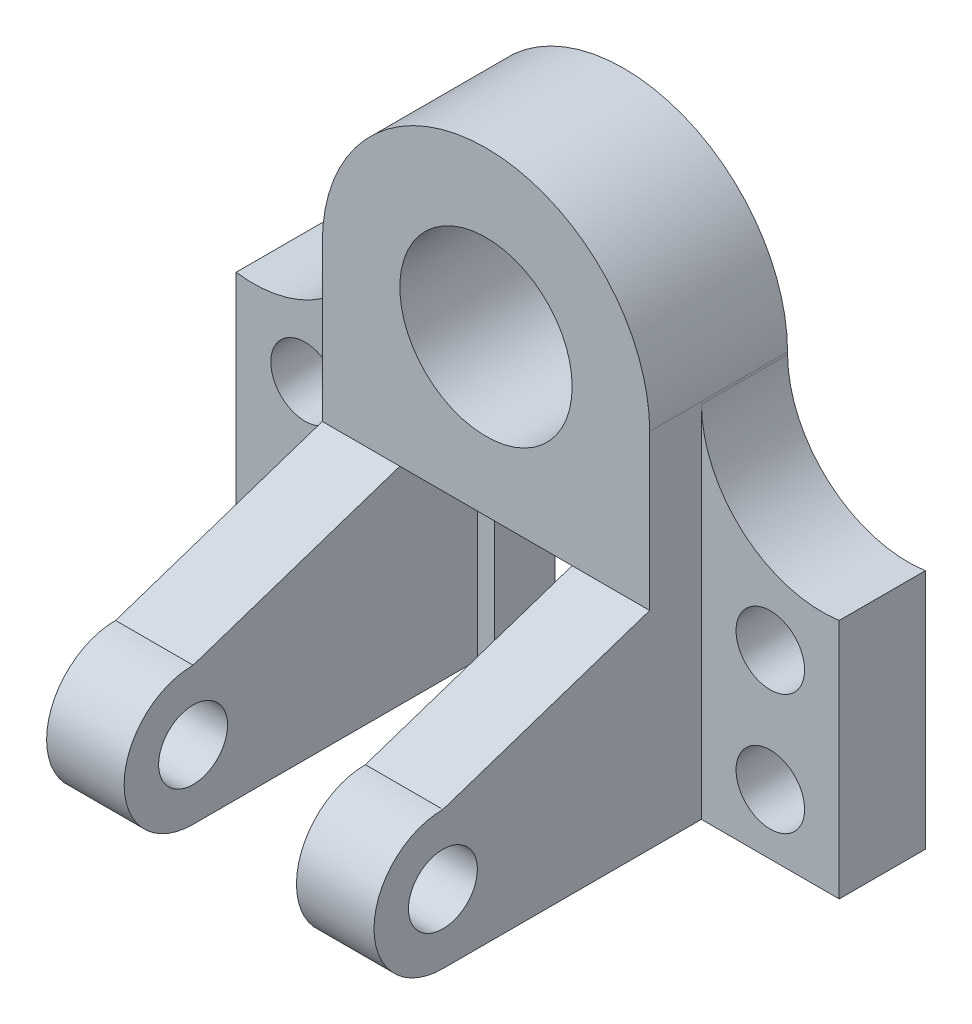
ISO-10303-21;
HEADER;
FILE_DESCRIPTION(('STEP AP214'),'2;1');
FILE_NAME('part.step','',(''),(''),'','','');
FILE_SCHEMA(('AUTOMOTIVE_DESIGN { 1 0 10303 214 1 1 1 1 }'));
ENDSEC;
DATA;
#1=APPLICATION_CONTEXT('core data for automotive mechanical design processes');
#2=APPLICATION_PROTOCOL_DEFINITION('international standard','automotive_design',2000,#1);
#3=PRODUCT_CONTEXT('',#1,'mechanical');
#4=PRODUCT('Part','Part','',(#3));
#5=PRODUCT_RELATED_PRODUCT_CATEGORY('part','',(#4));
#6=PRODUCT_DEFINITION_FORMATION('','',#4);
#7=PRODUCT_DEFINITION_CONTEXT('part definition',#1,'design');
#8=PRODUCT_DEFINITION('design','',#6,#7);
#9=PRODUCT_DEFINITION_SHAPE('','',#8);
#10=(LENGTH_UNIT() NAMED_UNIT(*) SI_UNIT(.MILLI.,.METRE.));
#11=(NAMED_UNIT(*) PLANE_ANGLE_UNIT() SI_UNIT($,.RADIAN.));
#12=(NAMED_UNIT(*) SI_UNIT($,.STERADIAN.) SOLID_ANGLE_UNIT());
#13=UNCERTAINTY_MEASURE_WITH_UNIT(LENGTH_MEASURE(1.E-05),#10,'distance_accuracy_value','');
#14=(GEOMETRIC_REPRESENTATION_CONTEXT(3) GLOBAL_UNCERTAINTY_ASSIGNED_CONTEXT((#13)) GLOBAL_UNIT_ASSIGNED_CONTEXT((#10,
#11,#12)) REPRESENTATION_CONTEXT('',''));
#15=CARTESIAN_POINT('',(0.,0.,0.));
#16=DIRECTION('',(0.,0.,1.));
#17=DIRECTION('',(1.,0.,0.));
#18=AXIS2_PLACEMENT_3D('',#15,#16,#17);
#19=CARTESIAN_POINT('',(20.,-69.,80.));
#20=DIRECTION('',(1.,0.,0.));
#21=DIRECTION('',(0.,0.,-1.));
#22=AXIS2_PLACEMENT_3D('',#19,#20,#21);
#23=CYLINDRICAL_SURFACE('',#22,8.00000000000001);
#24=CARTESIAN_POINT('',(20.,-69.,80.));
#25=DIRECTION('',(1.,0.,0.));
#26=DIRECTION('',(0.,0.,-1.));
#27=AXIS2_PLACEMENT_3D('',#24,#25,#26);
#28=CIRCLE('',#27,8.00000000000001);
#29=CARTESIAN_POINT('',(20.,-69.,72.));
#30=VERTEX_POINT('',#29);
#31=EDGE_CURVE('E211',#30,#30,#28,.T.);
#32=ORIENTED_EDGE('',*,*,#31,.F.);
#33=EDGE_LOOP('',(#32));
#34=FACE_BOUND('',#33,.T.);
#35=CARTESIAN_POINT('',(38.,-69.,80.));
#36=DIRECTION('',(1.,0.,0.));
#37=DIRECTION('',(0.,0.,-1.));
#38=AXIS2_PLACEMENT_3D('',#35,#36,#37);
#39=CIRCLE('',#38,8.00000000000001);
#40=CARTESIAN_POINT('',(38.,-69.,72.));
#41=VERTEX_POINT('',#40);
#42=EDGE_CURVE('E205',#41,#41,#39,.T.);
#43=ORIENTED_EDGE('',*,*,#42,.T.);
#44=EDGE_LOOP('',(#43));
#45=FACE_BOUND('',#44,.T.);
#46=ADVANCED_FACE('F38',(#34,#45),#23,.F.);
#47=CARTESIAN_POINT('',(-38.,-37.,32.));
#48=DIRECTION('',(0.,1.,0.));
#49=DIRECTION('',(0.,0.,1.));
#50=AXIS2_PLACEMENT_3D('',#47,#48,#49);
#51=PLANE('',#50);
#52=DIRECTION('',(0.,0.,-1.));
#53=VECTOR('',#52,1.);
#54=CARTESIAN_POINT('',(-20.,-37.,80.));
#55=LINE('',#54,#53);
#56=CARTESIAN_POINT('',(-20.,-37.,32.));
#57=VERTEX_POINT('',#56);
#58=CARTESIAN_POINT('',(-20.,-37.,14.));
#59=VERTEX_POINT('',#58);
#60=EDGE_CURVE('E190',#57,#59,#55,.T.);
#61=ORIENTED_EDGE('',*,*,#60,.T.);
#62=DIRECTION('',(-1.,0.,0.));
#63=VECTOR('',#62,1.);
#64=CARTESIAN_POINT('',(-38.,-37.,14.));
#65=LINE('',#64,#63);
#66=CARTESIAN_POINT('',(-16.,-37.,14.));
#67=VERTEX_POINT('',#66);
#68=EDGE_CURVE('E258',#67,#59,#65,.T.);
#69=ORIENTED_EDGE('',*,*,#68,.F.);
#70=DIRECTION('',(0.,0.,-1.));
#71=VECTOR('',#70,1.);
#72=CARTESIAN_POINT('',(-16.,-37.,14.));
#73=LINE('',#72,#71);
#74=CARTESIAN_POINT('',(-16.,-37.,0.));
#75=VERTEX_POINT('',#74);
#76=EDGE_CURVE('E261',#67,#75,#73,.T.);
#77=ORIENTED_EDGE('',*,*,#76,.T.);
#78=DIRECTION('',(1.,0.,0.));
#79=VECTOR('',#78,1.);
#80=CARTESIAN_POINT('',(-38.,-37.,0.));
#81=LINE('',#80,#79);
#82=CARTESIAN_POINT('',(16.,-37.,0.));
#83=VERTEX_POINT('',#82);
#84=EDGE_CURVE('E354',#75,#83,#81,.T.);
#85=ORIENTED_EDGE('',*,*,#84,.T.);
#86=DIRECTION('',(0.,0.,-1.));
#87=VECTOR('',#86,1.);
#88=CARTESIAN_POINT('',(16.,-37.,14.));
#89=LINE('',#88,#87);
#90=CARTESIAN_POINT('',(16.,-37.,14.));
#91=VERTEX_POINT('',#90);
#92=EDGE_CURVE('E251',#91,#83,#89,.T.);
#93=ORIENTED_EDGE('',*,*,#92,.F.);
#94=DIRECTION('',(-1.,0.,0.));
#95=VECTOR('',#94,1.);
#96=CARTESIAN_POINT('',(38.,-37.,14.));
#97=LINE('',#96,#95);
#98=CARTESIAN_POINT('',(20.,-37.,14.));
#99=VERTEX_POINT('',#98);
#100=EDGE_CURVE('E240',#99,#91,#97,.T.);
#101=ORIENTED_EDGE('',*,*,#100,.F.);
#102=DIRECTION('',(0.,0.,-1.));
#103=VECTOR('',#102,1.);
#104=CARTESIAN_POINT('',(20.,-37.,80.));
#105=LINE('',#104,#103);
#106=CARTESIAN_POINT('',(20.,-37.,32.));
#107=VERTEX_POINT('',#106);
#108=EDGE_CURVE('E226',#107,#99,#105,.T.);
#109=ORIENTED_EDGE('',*,*,#108,.F.);
#110=DIRECTION('',(1.,0.,0.));
#111=VECTOR('',#110,1.);
#112=CARTESIAN_POINT('',(-38.,-37.,32.));
#113=LINE('',#112,#111);
#114=EDGE_CURVE('E357',#57,#107,#113,.T.);
#115=ORIENTED_EDGE('',*,*,#114,.F.);
#116=EDGE_LOOP('',(#61,#69,#77,#85,#93,#101,#109,#115));
#117=FACE_BOUND('',#116,.T.);
#118=ADVANCED_FACE('F439',(#117),#51,.F.);
#119=CARTESIAN_POINT('',(0.,0.,14.));
#120=DIRECTION('',(0.,0.,1.));
#121=DIRECTION('',(1.,0.,0.));
#122=AXIS2_PLACEMENT_3D('',#119,#120,#121);
#123=PLANE('',#122);
#124=ORIENTED_EDGE('',*,*,#68,.T.);
#125=DIRECTION('',(0.,1.,0.));
#126=VECTOR('',#125,1.);
#127=CARTESIAN_POINT('',(-20.,-37.,14.));
#128=LINE('',#127,#126);
#129=CARTESIAN_POINT('',(-20.,-85.,14.));
#130=VERTEX_POINT('',#129);
#131=EDGE_CURVE('E191',#130,#59,#128,.T.);
#132=ORIENTED_EDGE('',*,*,#131,.F.);
#133=DIRECTION('',(1.,0.,0.));
#134=VECTOR('',#133,1.);
#135=CARTESIAN_POINT('',(-38.,-85.,14.));
#136=LINE('',#135,#134);
#137=CARTESIAN_POINT('',(-16.,-85.,14.));
#138=VERTEX_POINT('',#137);
#139=EDGE_CURVE('E202',#130,#138,#136,.T.);
#140=ORIENTED_EDGE('',*,*,#139,.T.);
#141=DIRECTION('',(0.,1.,0.));
#142=VECTOR('',#141,1.);
#143=CARTESIAN_POINT('',(-16.,-37.,14.));
#144=LINE('',#143,#142);
#145=EDGE_CURVE('E255',#138,#67,#144,.T.);
#146=ORIENTED_EDGE('',*,*,#145,.T.);
#147=EDGE_LOOP('',(#124,#132,#140,#146));
#148=FACE_BOUND('',#147,.T.);
#149=ADVANCED_FACE('F442',(#148),#123,.T.);
#150=CARTESIAN_POINT('',(38.,-37.,32.));
#151=DIRECTION('',(-1.,0.,0.));
#152=DIRECTION('',(0.,0.,1.));
#153=AXIS2_PLACEMENT_3D('',#150,#151,#152);
#154=PLANE('',#153);
#155=ORIENTED_EDGE('',*,*,#42,.F.);
#156=EDGE_LOOP('',(#155));
#157=FACE_BOUND('',#156,.T.);
#158=DIRECTION('',(0.,1.,0.));
#159=VECTOR('',#158,1.);
#160=CARTESIAN_POINT('',(38.,-37.,32.));
#161=LINE('',#160,#159);
#162=CARTESIAN_POINT('',(38.,-37.,32.));
#163=VERTEX_POINT('',#162);
#164=CARTESIAN_POINT('',(38.,-1.,32.));
#165=VERTEX_POINT('',#164);
#166=EDGE_CURVE('E350',#163,#165,#161,.T.);
#167=ORIENTED_EDGE('',*,*,#166,.F.);
#168=DIRECTION('',(0.,0.316227766016838,-0.948683298050514));
#169=VECTOR('',#168,1.);
#170=CARTESIAN_POINT('',(38.,-23.7,-7.9));
#171=LINE('',#170,#169);
#172=CARTESIAN_POINT('',(38.,-53.,80.));
#173=VERTEX_POINT('',#172);
#174=EDGE_CURVE('E400',#173,#163,#171,.T.);
#175=ORIENTED_EDGE('',*,*,#174,.F.);
#176=CARTESIAN_POINT('',(38.,-69.,80.));
#177=DIRECTION('',(1.,0.,0.));
#178=DIRECTION('',(0.,0.,-1.));
#179=AXIS2_PLACEMENT_3D('',#176,#177,#178);
#180=CIRCLE('',#179,16.);
#181=CARTESIAN_POINT('',(38.,-85.,80.));
#182=VERTEX_POINT('',#181);
#183=EDGE_CURVE('E214',#173,#182,#180,.T.);
#184=ORIENTED_EDGE('',*,*,#183,.T.);
#185=DIRECTION('',(0.,0.,-1.));
#186=VECTOR('',#185,1.);
#187=CARTESIAN_POINT('',(38.,-85.,80.));
#188=LINE('',#187,#186);
#189=CARTESIAN_POINT('',(38.,-85.,20.));
#190=VERTEX_POINT('',#189);
#191=EDGE_CURVE('E231',#182,#190,#188,.T.);
#192=ORIENTED_EDGE('',*,*,#191,.T.);
#193=DIRECTION('',(0.,-1.,0.));
#194=VECTOR('',#193,1.);
#195=CARTESIAN_POINT('',(38.,0.,20.));
#196=LINE('',#195,#194);
#197=CARTESIAN_POINT('',(38.,-1.57480003864419,20.));
#198=VERTEX_POINT('',#197);
#199=EDGE_CURVE('E317',#198,#190,#196,.T.);
#200=ORIENTED_EDGE('',*,*,#199,.F.);
#201=DIRECTION('',(0.,0.,-1.));
#202=VECTOR('',#201,1.);
#203=CARTESIAN_POINT('',(38.,-1.57480003864419,20.));
#204=LINE('',#203,#202);
#205=CARTESIAN_POINT('',(38.,-1.57480003864419,0.));
#206=VERTEX_POINT('',#205);
#207=EDGE_CURVE('E341',#198,#206,#204,.T.);
#208=ORIENTED_EDGE('',*,*,#207,.T.);
#209=DIRECTION('',(0.,1.,0.));
#210=VECTOR('',#209,1.);
#211=CARTESIAN_POINT('',(38.,-37.,0.));
#212=LINE('',#211,#210);
#213=CARTESIAN_POINT('',(38.,-1.,0.));
#214=VERTEX_POINT('',#213);
#215=EDGE_CURVE('E347',#206,#214,#212,.T.);
#216=ORIENTED_EDGE('',*,*,#215,.T.);
#217=DIRECTION('',(0.,0.,-1.));
#218=VECTOR('',#217,1.);
#219=CARTESIAN_POINT('',(38.,-1.,32.));
#220=LINE('',#219,#218);
#221=EDGE_CURVE('E361',#214,#165,#220,.F.);
#222=ORIENTED_EDGE('',*,*,#221,.T.);
#223=EDGE_LOOP('',(#167,#175,#184,#192,#200,#208,#216,#222));
#224=FACE_BOUND('',#223,.T.);
#225=ADVANCED_FACE('F386',(#157,#224),#154,.F.);
#226=CARTESIAN_POINT('',(20.,-37.,80.));
#227=DIRECTION('',(1.,0.,0.));
#228=DIRECTION('',(0.,0.,-1.));
#229=AXIS2_PLACEMENT_3D('',#226,#227,#228);
#230=PLANE('',#229);
#231=ORIENTED_EDGE('',*,*,#31,.T.);
#232=EDGE_LOOP('',(#231));
#233=FACE_BOUND('',#232,.T.);
#234=CARTESIAN_POINT('',(20.,-69.,80.));
#235=DIRECTION('',(1.,0.,0.));
#236=DIRECTION('',(0.,0.,-1.));
#237=AXIS2_PLACEMENT_3D('',#234,#235,#236);
#238=CIRCLE('',#237,16.);
#239=CARTESIAN_POINT('',(20.,-53.,80.));
#240=VERTEX_POINT('',#239);
#241=CARTESIAN_POINT('',(20.,-85.,80.));
#242=VERTEX_POINT('',#241);
#243=EDGE_CURVE('E217',#240,#242,#238,.T.);
#244=ORIENTED_EDGE('',*,*,#243,.F.);
#245=DIRECTION('',(0.,0.316227766016838,-0.948683298050514));
#246=VECTOR('',#245,1.);
#247=CARTESIAN_POINT('',(20.,-51.4,75.2));
#248=LINE('',#247,#246);
#249=EDGE_CURVE('E398',#240,#107,#248,.T.);
#250=ORIENTED_EDGE('',*,*,#249,.T.);
#251=ORIENTED_EDGE('',*,*,#108,.T.);
#252=DIRECTION('',(0.,-1.,0.));
#253=VECTOR('',#252,1.);
#254=CARTESIAN_POINT('',(20.,-37.,14.));
#255=LINE('',#254,#253);
#256=CARTESIAN_POINT('',(20.,-85.,14.));
#257=VERTEX_POINT('',#256);
#258=EDGE_CURVE('E223',#99,#257,#255,.T.);
#259=ORIENTED_EDGE('',*,*,#258,.T.);
#260=DIRECTION('',(0.,0.,-1.));
#261=VECTOR('',#260,1.);
#262=CARTESIAN_POINT('',(20.,-85.,80.));
#263=LINE('',#262,#261);
#264=EDGE_CURVE('E234',#242,#257,#263,.T.);
#265=ORIENTED_EDGE('',*,*,#264,.F.);
#266=EDGE_LOOP('',(#244,#250,#251,#259,#265));
#267=FACE_BOUND('',#266,.T.);
#268=ADVANCED_FACE('F403',(#233,#267),#230,.F.);
#269=CARTESIAN_POINT('',(0.,0.,14.));
#270=DIRECTION('',(0.,0.,-1.));
#271=DIRECTION('',(-1.,0.,0.));
#272=AXIS2_PLACEMENT_3D('',#269,#270,#271);
#273=PLANE('',#272);
#274=ORIENTED_EDGE('',*,*,#258,.F.);
#275=ORIENTED_EDGE('',*,*,#100,.T.);
#276=DIRECTION('',(0.,-1.,0.));
#277=VECTOR('',#276,1.);
#278=CARTESIAN_POINT('',(16.,-37.,14.));
#279=LINE('',#278,#277);
#280=CARTESIAN_POINT('',(16.,-85.,14.));
#281=VERTEX_POINT('',#280);
#282=EDGE_CURVE('E242',#91,#281,#279,.T.);
#283=ORIENTED_EDGE('',*,*,#282,.T.);
#284=DIRECTION('',(1.,0.,0.));
#285=VECTOR('',#284,1.);
#286=CARTESIAN_POINT('',(38.,-85.,14.));
#287=LINE('',#286,#285);
#288=EDGE_CURVE('E244',#281,#257,#287,.T.);
#289=ORIENTED_EDGE('',*,*,#288,.T.);
#290=EDGE_LOOP('',(#274,#275,#283,#289));
#291=FACE_BOUND('',#290,.T.);
#292=ADVANCED_FACE('F471',(#291),#273,.F.);
#293=CARTESIAN_POINT('',(-38.,-37.,32.));
#294=DIRECTION('',(1.,0.,0.));
#295=DIRECTION('',(0.,0.,-1.));
#296=AXIS2_PLACEMENT_3D('',#293,#294,#295);
#297=PLANE('',#296);
#298=DIRECTION('',(0.,0.,-1.));
#299=VECTOR('',#298,1.);
#300=CARTESIAN_POINT('',(-38.,-85.,80.));
#301=LINE('',#300,#299);
#302=CARTESIAN_POINT('',(-38.,-85.,80.));
#303=VERTEX_POINT('',#302);
#304=CARTESIAN_POINT('',(-38.,-85.,20.));
#305=VERTEX_POINT('',#304);
#306=EDGE_CURVE('E203',#303,#305,#301,.T.);
#307=ORIENTED_EDGE('',*,*,#306,.F.);
#308=CARTESIAN_POINT('',(-38.,-69.,80.));
#309=DIRECTION('',(-1.,0.,0.));
#310=DIRECTION('',(0.,0.,1.));
#311=AXIS2_PLACEMENT_3D('',#308,#309,#310);
#312=CIRCLE('',#311,16.);
#313=CARTESIAN_POINT('',(-38.,-53.,80.));
#314=VERTEX_POINT('',#313);
#315=EDGE_CURVE('E186',#303,#314,#312,.T.);
#316=ORIENTED_EDGE('',*,*,#315,.T.);
#317=DIRECTION('',(0.,-0.316227766016838,0.948683298050514));
#318=VECTOR('',#317,1.);
#319=CARTESIAN_POINT('',(-38.,-23.7,-7.9));
#320=LINE('',#319,#318);
#321=CARTESIAN_POINT('',(-38.,-37.,32.));
#322=VERTEX_POINT('',#321);
#323=EDGE_CURVE('E54',#322,#314,#320,.T.);
#324=ORIENTED_EDGE('',*,*,#323,.F.);
#325=DIRECTION('',(0.,-1.,0.));
#326=VECTOR('',#325,1.);
#327=CARTESIAN_POINT('',(-38.,-37.,32.));
#328=LINE('',#327,#326);
#329=CARTESIAN_POINT('',(-38.,-1.,32.));
#330=VERTEX_POINT('',#329);
#331=EDGE_CURVE('E353',#330,#322,#328,.T.);
#332=ORIENTED_EDGE('',*,*,#331,.F.);
#333=DIRECTION('',(0.,0.,-1.));
#334=VECTOR('',#333,1.);
#335=CARTESIAN_POINT('',(-38.,-1.,32.));
#336=LINE('',#335,#334);
#337=CARTESIAN_POINT('',(-38.,-1.,0.));
#338=VERTEX_POINT('',#337);
#339=EDGE_CURVE('E370',#330,#338,#336,.T.);
#340=ORIENTED_EDGE('',*,*,#339,.T.);
#341=DIRECTION('',(0.,-1.,0.));
#342=VECTOR('',#341,1.);
#343=CARTESIAN_POINT('',(-38.,-37.,0.));
#344=LINE('',#343,#342);
#345=CARTESIAN_POINT('',(-38.,-1.57480003864419,0.));
#346=VERTEX_POINT('',#345);
#347=EDGE_CURVE('E363',#338,#346,#344,.T.);
#348=ORIENTED_EDGE('',*,*,#347,.T.);
#349=DIRECTION('',(0.,0.,-1.));
#350=VECTOR('',#349,1.);
#351=CARTESIAN_POINT('',(-38.,-1.57480003864419,20.));
#352=LINE('',#351,#350);
#353=CARTESIAN_POINT('',(-38.,-1.57480003864419,20.));
#354=VERTEX_POINT('',#353);
#355=EDGE_CURVE('E304',#354,#346,#352,.T.);
#356=ORIENTED_EDGE('',*,*,#355,.F.);
#357=DIRECTION('',(0.,-1.,0.));
#358=VECTOR('',#357,1.);
#359=CARTESIAN_POINT('',(-38.,0.,20.));
#360=LINE('',#359,#358);
#361=EDGE_CURVE('E272',#354,#305,#360,.T.);
#362=ORIENTED_EDGE('',*,*,#361,.T.);
#363=EDGE_LOOP('',(#307,#316,#324,#332,#340,#348,#356,#362));
#364=FACE_BOUND('',#363,.T.);
#365=CARTESIAN_POINT('',(-38.,-69.,80.));
#366=DIRECTION('',(1.,0.,0.));
#367=DIRECTION('',(0.,0.,-1.));
#368=AXIS2_PLACEMENT_3D('',#365,#366,#367);
#369=CIRCLE('',#368,8.00000000000001);
#370=CARTESIAN_POINT('',(-38.,-69.,72.));
#371=VERTEX_POINT('',#370);
#372=EDGE_CURVE('E197',#371,#371,#369,.F.);
#373=ORIENTED_EDGE('',*,*,#372,.F.);
#374=EDGE_LOOP('',(#373));
#375=FACE_BOUND('',#374,.T.);
#376=ADVANCED_FACE('F418',(#364,#375),#297,.F.);
#377=CARTESIAN_POINT('',(0.,-1.,0.));
#378=DIRECTION('',(0.,0.,-1.));
#379=DIRECTION('',(-1.,0.,0.));
#380=AXIS2_PLACEMENT_3D('',#377,#378,#379);
#381=CYLINDRICAL_SURFACE('',#380,38.);
#382=ORIENTED_EDGE('',*,*,#221,.F.);
#383=CARTESIAN_POINT('',(0.,-1.,0.));
#384=DIRECTION('',(0.,0.,-1.));
#385=DIRECTION('',(-1.,0.,0.));
#386=AXIS2_PLACEMENT_3D('',#383,#384,#385);
#387=CIRCLE('',#386,38.);
#388=EDGE_CURVE('E47',#338,#214,#387,.T.);
#389=ORIENTED_EDGE('',*,*,#388,.F.);
#390=ORIENTED_EDGE('',*,*,#339,.F.);
#391=CARTESIAN_POINT('',(0.,-1.,32.));
#392=DIRECTION('',(0.,0.,-1.));
#393=DIRECTION('',(-1.,0.,0.));
#394=AXIS2_PLACEMENT_3D('',#391,#392,#393);
#395=CIRCLE('',#394,38.);
#396=EDGE_CURVE('E12',#165,#330,#395,.F.);
#397=ORIENTED_EDGE('',*,*,#396,.F.);
#398=EDGE_LOOP('',(#382,#389,#390,#397));
#399=FACE_BOUND('',#398,.T.);
#400=ADVANCED_FACE('F41',(#399),#381,.T.);
#401=CARTESIAN_POINT('',(0.,0.,32.));
#402=DIRECTION('',(0.,0.,-1.));
#403=DIRECTION('',(-1.,0.,0.));
#404=AXIS2_PLACEMENT_3D('',#401,#402,#403);
#405=PLANE('',#404);
#406=ORIENTED_EDGE('',*,*,#166,.T.);
#407=ORIENTED_EDGE('',*,*,#396,.T.);
#408=ORIENTED_EDGE('',*,*,#331,.T.);
#409=EDGE_CURVE('E358',#322,#57,#113,.T.);
#410=ORIENTED_EDGE('',*,*,#409,.T.);
#411=ORIENTED_EDGE('',*,*,#114,.T.);
#412=DIRECTION('',(-1.,0.,0.));
#413=VECTOR('',#412,1.);
#414=CARTESIAN_POINT('',(0.,-37.,32.));
#415=LINE('',#414,#413);
#416=EDGE_CURVE('E237',#163,#107,#415,.T.);
#417=ORIENTED_EDGE('',*,*,#416,.F.);
#418=EDGE_LOOP('',(#406,#407,#408,#410,#411,#417));
#419=FACE_BOUND('',#418,.T.);
#420=CARTESIAN_POINT('',(0.,-1.,32.));
#421=DIRECTION('',(0.,0.,1.));
#422=DIRECTION('',(1.,0.,0.));
#423=AXIS2_PLACEMENT_3D('',#420,#421,#422);
#424=CIRCLE('',#423,20.);
#425=CARTESIAN_POINT('',(20.,-1.,32.));
#426=VERTEX_POINT('',#425);
#427=EDGE_CURVE('E344',#426,#426,#424,.T.);
#428=ORIENTED_EDGE('',*,*,#427,.F.);
#429=EDGE_LOOP('',(#428));
#430=FACE_BOUND('',#429,.T.);
#431=ADVANCED_FACE('F390',(#419,#430),#405,.F.);
#432=CARTESIAN_POINT('',(0.,0.,0.));
#433=DIRECTION('',(0.,0.,-1.));
#434=DIRECTION('',(-1.,0.,0.));
#435=AXIS2_PLACEMENT_3D('',#432,#433,#434);
#436=PLANE('',#435);
#437=DIRECTION('',(0.,-1.,0.));
#438=VECTOR('',#437,1.);
#439=CARTESIAN_POINT('',(16.,-37.,0.));
#440=LINE('',#439,#438);
#441=CARTESIAN_POINT('',(16.,-85.,0.));
#442=VERTEX_POINT('',#441);
#443=EDGE_CURVE('E239',#83,#442,#440,.T.);
#444=ORIENTED_EDGE('',*,*,#443,.F.);
#445=ORIENTED_EDGE('',*,*,#84,.F.);
#446=DIRECTION('',(0.,1.,0.));
#447=VECTOR('',#446,1.);
#448=CARTESIAN_POINT('',(-16.,-37.,0.));
#449=LINE('',#448,#447);
#450=CARTESIAN_POINT('',(-16.,-85.,0.));
#451=VERTEX_POINT('',#450);
#452=EDGE_CURVE('E253',#451,#75,#449,.T.);
#453=ORIENTED_EDGE('',*,*,#452,.F.);
#454=DIRECTION('',(-1.,0.,0.));
#455=VECTOR('',#454,1.);
#456=CARTESIAN_POINT('',(0.,-85.,0.));
#457=LINE('',#456,#455);
#458=CARTESIAN_POINT('',(-70.,-85.,0.));
#459=VERTEX_POINT('',#458);
#460=EDGE_CURVE('E295',#451,#459,#457,.T.);
#461=ORIENTED_EDGE('',*,*,#460,.T.);
#462=DIRECTION('',(0.,-1.,0.));
#463=VECTOR('',#462,1.);
#464=CARTESIAN_POINT('',(-70.,0.,0.));
#465=LINE('',#464,#463);
#466=CARTESIAN_POINT('',(-70.,-29.,0.));
#467=VERTEX_POINT('',#466);
#468=EDGE_CURVE('E292',#467,#459,#465,.T.);
#469=ORIENTED_EDGE('',*,*,#468,.F.);
#470=CARTESIAN_POINT('',(-65.9985249830932,-1.28740001932206,0.));
#471=DIRECTION('',(0.,0.,1.));
#472=DIRECTION('',(1.,0.,0.));
#473=AXIS2_PLACEMENT_3D('',#470,#471,#472);
#474=CIRCLE('',#473,28.);
#475=EDGE_CURVE('E289',#346,#467,#474,.F.);
#476=ORIENTED_EDGE('',*,*,#475,.F.);
#477=ORIENTED_EDGE('',*,*,#347,.F.);
#478=ORIENTED_EDGE('',*,*,#388,.T.);
#479=ORIENTED_EDGE('',*,*,#215,.F.);
#480=CARTESIAN_POINT('',(65.9985249830932,-1.28740001932206,0.));
#481=DIRECTION('',(0.,0.,1.));
#482=DIRECTION('',(1.,0.,0.));
#483=AXIS2_PLACEMENT_3D('',#480,#481,#482);
#484=CIRCLE('',#483,28.);
#485=CARTESIAN_POINT('',(70.,-29.,0.));
#486=VERTEX_POINT('',#485);
#487=EDGE_CURVE('E330',#206,#486,#484,.T.);
#488=ORIENTED_EDGE('',*,*,#487,.T.);
#489=DIRECTION('',(0.,-1.,0.));
#490=VECTOR('',#489,1.);
#491=CARTESIAN_POINT('',(70.,0.,0.));
#492=LINE('',#491,#490);
#493=CARTESIAN_POINT('',(70.,-85.,0.));
#494=VERTEX_POINT('',#493);
#495=EDGE_CURVE('E311',#486,#494,#492,.T.);
#496=ORIENTED_EDGE('',*,*,#495,.T.);
#497=DIRECTION('',(1.,0.,0.));
#498=VECTOR('',#497,1.);
#499=CARTESIAN_POINT('',(0.,-85.,0.));
#500=LINE('',#499,#498);
#501=EDGE_CURVE('E333',#442,#494,#500,.T.);
#502=ORIENTED_EDGE('',*,*,#501,.F.);
#503=EDGE_LOOP('',(#444,#445,#453,#461,#469,#476,#477,#478,#479,#488,#496,#502));
#504=FACE_BOUND('',#503,.T.);
#505=CARTESIAN_POINT('',(0.,-1.,0.));
#506=DIRECTION('',(0.,0.,1.));
#507=DIRECTION('',(1.,0.,0.));
#508=AXIS2_PLACEMENT_3D('',#505,#506,#507);
#509=CIRCLE('',#508,20.);
#510=CARTESIAN_POINT('',(20.,-1.,0.));
#511=VERTEX_POINT('',#510);
#512=EDGE_CURVE('E343',#511,#511,#509,.T.);
#513=ORIENTED_EDGE('',*,*,#512,.T.);
#514=EDGE_LOOP('',(#513));
#515=FACE_BOUND('',#514,.T.);
#516=CARTESIAN_POINT('',(54.,-71.,0.));
#517=DIRECTION('',(0.,0.,1.));
#518=DIRECTION('',(1.,0.,0.));
#519=AXIS2_PLACEMENT_3D('',#516,#517,#518);
#520=CIRCLE('',#519,7.95659765871734);
#521=CARTESIAN_POINT('',(61.9565976587173,-71.,0.));
#522=VERTEX_POINT('',#521);
#523=EDGE_CURVE('E306',#522,#522,#520,.T.);
#524=ORIENTED_EDGE('',*,*,#523,.T.);
#525=EDGE_LOOP('',(#524));
#526=FACE_BOUND('',#525,.T.);
#527=CARTESIAN_POINT('',(54.,-43.,0.));
#528=DIRECTION('',(0.,0.,1.));
#529=DIRECTION('',(1.,0.,0.));
#530=AXIS2_PLACEMENT_3D('',#527,#528,#529);
#531=CIRCLE('',#530,7.95659765871734);
#532=CARTESIAN_POINT('',(61.9565976587173,-43.,0.));
#533=VERTEX_POINT('',#532);
#534=EDGE_CURVE('E327',#533,#533,#531,.T.);
#535=ORIENTED_EDGE('',*,*,#534,.T.);
#536=EDGE_LOOP('',(#535));
#537=FACE_BOUND('',#536,.T.);
#538=CARTESIAN_POINT('',(-54.,-71.,0.));
#539=DIRECTION('',(0.,0.,1.));
#540=DIRECTION('',(1.,0.,0.));
#541=AXIS2_PLACEMENT_3D('',#538,#539,#540);
#542=CIRCLE('',#541,7.95659765871734);
#543=CARTESIAN_POINT('',(-46.0434023412827,-71.,0.));
#544=VERTEX_POINT('',#543);
#545=EDGE_CURVE('E268',#544,#544,#542,.F.);
#546=ORIENTED_EDGE('',*,*,#545,.F.);
#547=EDGE_LOOP('',(#546));
#548=FACE_BOUND('',#547,.T.);
#549=CARTESIAN_POINT('',(-54.,-43.,0.));
#550=DIRECTION('',(0.,0.,1.));
#551=DIRECTION('',(1.,0.,0.));
#552=AXIS2_PLACEMENT_3D('',#549,#550,#551);
#553=CIRCLE('',#552,7.95659765871734);
#554=CARTESIAN_POINT('',(-46.0434023412827,-43.,0.));
#555=VERTEX_POINT('',#554);
#556=EDGE_CURVE('E273',#555,#555,#553,.F.);
#557=ORIENTED_EDGE('',*,*,#556,.F.);
#558=EDGE_LOOP('',(#557));
#559=FACE_BOUND('',#558,.T.);
#560=ADVANCED_FACE('F378',(#504,#515,#526,#537,#548,#559),#436,.T.);
#561=CARTESIAN_POINT('',(0.,-1.,32.));
#562=DIRECTION('',(0.,0.,-1.));
#563=DIRECTION('',(-1.,0.,0.));
#564=AXIS2_PLACEMENT_3D('',#561,#562,#563);
#565=CYLINDRICAL_SURFACE('',#564,20.);
#566=ORIENTED_EDGE('',*,*,#427,.T.);
#567=EDGE_LOOP('',(#566));
#568=FACE_BOUND('',#567,.T.);
#569=ORIENTED_EDGE('',*,*,#512,.F.);
#570=EDGE_LOOP('',(#569));
#571=FACE_BOUND('',#570,.T.);
#572=ADVANCED_FACE('F519',(#568,#571),#565,.F.);
#573=CARTESIAN_POINT('',(65.9985249830932,-1.28740001932206,20.));
#574=DIRECTION('',(0.,0.,-1.));
#575=DIRECTION('',(-1.,0.,0.));
#576=AXIS2_PLACEMENT_3D('',#573,#574,#575);
#577=CYLINDRICAL_SURFACE('',#576,28.);
#578=ORIENTED_EDGE('',*,*,#487,.F.);
#579=ORIENTED_EDGE('',*,*,#207,.F.);
#580=CARTESIAN_POINT('',(65.9985249830932,-1.28740001932206,20.));
#581=DIRECTION('',(0.,0.,1.));
#582=DIRECTION('',(1.,0.,0.));
#583=AXIS2_PLACEMENT_3D('',#580,#581,#582);
#584=CIRCLE('',#583,28.);
#585=CARTESIAN_POINT('',(70.,-29.,20.));
#586=VERTEX_POINT('',#585);
#587=EDGE_CURVE('E314',#198,#586,#584,.T.);
#588=ORIENTED_EDGE('',*,*,#587,.T.);
#589=DIRECTION('',(0.,0.,-1.));
#590=VECTOR('',#589,1.);
#591=CARTESIAN_POINT('',(70.,-29.,20.));
#592=LINE('',#591,#590);
#593=EDGE_CURVE('E324',#586,#486,#592,.T.);
#594=ORIENTED_EDGE('',*,*,#593,.T.);
#595=EDGE_LOOP('',(#578,#579,#588,#594));
#596=FACE_BOUND('',#595,.T.);
#597=ADVANCED_FACE('F515',(#596),#577,.F.);
#598=CARTESIAN_POINT('',(0.,-85.,20.));
#599=DIRECTION('',(0.,1.,0.));
#600=DIRECTION('',(0.,0.,1.));
#601=AXIS2_PLACEMENT_3D('',#598,#599,#600);
#602=PLANE('',#601);
#603=DIRECTION('',(1.,0.,0.));
#604=VECTOR('',#603,1.);
#605=CARTESIAN_POINT('',(0.,-85.,20.));
#606=LINE('',#605,#604);
#607=CARTESIAN_POINT('',(70.,-85.,20.));
#608=VERTEX_POINT('',#607);
#609=EDGE_CURVE('E319',#190,#608,#606,.T.);
#610=ORIENTED_EDGE('',*,*,#609,.F.);
#611=ORIENTED_EDGE('',*,*,#191,.F.);
#612=DIRECTION('',(1.,0.,0.));
#613=VECTOR('',#612,1.);
#614=CARTESIAN_POINT('',(20.,-85.,80.));
#615=LINE('',#614,#613);
#616=EDGE_CURVE('E224',#242,#182,#615,.T.);
#617=ORIENTED_EDGE('',*,*,#616,.F.);
#618=ORIENTED_EDGE('',*,*,#264,.T.);
#619=ORIENTED_EDGE('',*,*,#288,.F.);
#620=DIRECTION('',(0.,0.,-1.));
#621=VECTOR('',#620,1.);
#622=CARTESIAN_POINT('',(16.,-85.,14.));
#623=LINE('',#622,#621);
#624=EDGE_CURVE('E246',#281,#442,#623,.T.);
#625=ORIENTED_EDGE('',*,*,#624,.T.);
#626=ORIENTED_EDGE('',*,*,#501,.T.);
#627=DIRECTION('',(0.,0.,-1.));
#628=VECTOR('',#627,1.);
#629=CARTESIAN_POINT('',(70.,-85.,20.));
#630=LINE('',#629,#628);
#631=EDGE_CURVE('E339',#608,#494,#630,.T.);
#632=ORIENTED_EDGE('',*,*,#631,.F.);
#633=EDGE_LOOP('',(#610,#611,#617,#618,#619,#625,#626,#632));
#634=FACE_BOUND('',#633,.T.);
#635=ADVANCED_FACE('F511',(#634),#602,.F.);
#636=CARTESIAN_POINT('',(54.,-43.,20.));
#637=DIRECTION('',(0.,0.,-1.));
#638=DIRECTION('',(-1.,0.,0.));
#639=AXIS2_PLACEMENT_3D('',#636,#637,#638);
#640=CYLINDRICAL_SURFACE('',#639,7.95659765871734);
#641=CARTESIAN_POINT('',(54.,-43.,20.));
#642=DIRECTION('',(0.,0.,1.));
#643=DIRECTION('',(1.,0.,0.));
#644=AXIS2_PLACEMENT_3D('',#641,#642,#643);
#645=CIRCLE('',#644,7.95659765871734);
#646=CARTESIAN_POINT('',(61.9565976587173,-43.,20.));
#647=VERTEX_POINT('',#646);
#648=EDGE_CURVE('E310',#647,#647,#645,.T.);
#649=ORIENTED_EDGE('',*,*,#648,.T.);
#650=EDGE_LOOP('',(#649));
#651=FACE_BOUND('',#650,.T.);
#652=ORIENTED_EDGE('',*,*,#534,.F.);
#653=EDGE_LOOP('',(#652));
#654=FACE_BOUND('',#653,.T.);
#655=ADVANCED_FACE('F514',(#651,#654),#640,.F.);
#656=CARTESIAN_POINT('',(54.,-71.,20.));
#657=DIRECTION('',(0.,0.,-1.));
#658=DIRECTION('',(-1.,0.,0.));
#659=AXIS2_PLACEMENT_3D('',#656,#657,#658);
#660=CYLINDRICAL_SURFACE('',#659,7.95659765871734);
#661=CARTESIAN_POINT('',(54.,-71.,20.));
#662=DIRECTION('',(0.,0.,1.));
#663=DIRECTION('',(1.,0.,0.));
#664=AXIS2_PLACEMENT_3D('',#661,#662,#663);
#665=CIRCLE('',#664,7.95659765871734);
#666=CARTESIAN_POINT('',(61.9565976587173,-71.,20.));
#667=VERTEX_POINT('',#666);
#668=EDGE_CURVE('E307',#667,#667,#665,.T.);
#669=ORIENTED_EDGE('',*,*,#668,.T.);
#670=EDGE_LOOP('',(#669));
#671=FACE_BOUND('',#670,.T.);
#672=ORIENTED_EDGE('',*,*,#523,.F.);
#673=EDGE_LOOP('',(#672));
#674=FACE_BOUND('',#673,.T.);
#675=ADVANCED_FACE('F509',(#671,#674),#660,.F.);
#676=CARTESIAN_POINT('',(70.,0.,20.));
#677=DIRECTION('',(1.,0.,0.));
#678=DIRECTION('',(0.,1.,0.));
#679=AXIS2_PLACEMENT_3D('',#676,#677,#678);
#680=PLANE('',#679);
#681=ORIENTED_EDGE('',*,*,#495,.F.);
#682=ORIENTED_EDGE('',*,*,#593,.F.);
#683=DIRECTION('',(0.,-1.,0.));
#684=VECTOR('',#683,1.);
#685=CARTESIAN_POINT('',(70.,0.,20.));
#686=LINE('',#685,#684);
#687=EDGE_CURVE('E321',#586,#608,#686,.T.);
#688=ORIENTED_EDGE('',*,*,#687,.T.);
#689=ORIENTED_EDGE('',*,*,#631,.T.);
#690=EDGE_LOOP('',(#681,#682,#688,#689));
#691=FACE_BOUND('',#690,.T.);
#692=ADVANCED_FACE('F505',(#691),#680,.T.);
#693=CARTESIAN_POINT('',(0.,0.,20.));
#694=DIRECTION('',(0.,0.,1.));
#695=DIRECTION('',(1.,0.,0.));
#696=AXIS2_PLACEMENT_3D('',#693,#694,#695);
#697=PLANE('',#696);
#698=ORIENTED_EDGE('',*,*,#668,.F.);
#699=EDGE_LOOP('',(#698));
#700=FACE_BOUND('',#699,.T.);
#701=ORIENTED_EDGE('',*,*,#648,.F.);
#702=EDGE_LOOP('',(#701));
#703=FACE_BOUND('',#702,.T.);
#704=ORIENTED_EDGE('',*,*,#587,.F.);
#705=ORIENTED_EDGE('',*,*,#199,.T.);
#706=ORIENTED_EDGE('',*,*,#609,.T.);
#707=ORIENTED_EDGE('',*,*,#687,.F.);
#708=EDGE_LOOP('',(#704,#705,#706,#707));
#709=FACE_BOUND('',#708,.T.);
#710=ADVANCED_FACE('F498',(#700,#703,#709),#697,.T.);
#711=CARTESIAN_POINT('',(-65.9985249830932,-1.28740001932206,20.));
#712=DIRECTION('',(0.,0.,-1.));
#713=DIRECTION('',(-1.,0.,0.));
#714=AXIS2_PLACEMENT_3D('',#711,#712,#713);
#715=CYLINDRICAL_SURFACE('',#714,28.);
#716=ORIENTED_EDGE('',*,*,#475,.T.);
#717=DIRECTION('',(0.,0.,-1.));
#718=VECTOR('',#717,1.);
#719=CARTESIAN_POINT('',(-70.,-29.,20.));
#720=LINE('',#719,#718);
#721=CARTESIAN_POINT('',(-70.,-29.,20.));
#722=VERTEX_POINT('',#721);
#723=EDGE_CURVE('E301',#722,#467,#720,.T.);
#724=ORIENTED_EDGE('',*,*,#723,.F.);
#725=CARTESIAN_POINT('',(-65.9985249830932,-1.28740001932206,20.));
#726=DIRECTION('',(0.,0.,1.));
#727=DIRECTION('',(1.,0.,0.));
#728=AXIS2_PLACEMENT_3D('',#725,#726,#727);
#729=CIRCLE('',#728,28.);
#730=EDGE_CURVE('E275',#354,#722,#729,.F.);
#731=ORIENTED_EDGE('',*,*,#730,.F.);
#732=ORIENTED_EDGE('',*,*,#355,.T.);
#733=EDGE_LOOP('',(#716,#724,#731,#732));
#734=FACE_BOUND('',#733,.T.);
#735=ADVANCED_FACE('F495',(#734),#715,.F.);
#736=CARTESIAN_POINT('',(-70.,0.,20.));
#737=DIRECTION('',(1.,0.,0.));
#738=DIRECTION('',(0.,1.,0.));
#739=AXIS2_PLACEMENT_3D('',#736,#737,#738);
#740=PLANE('',#739);
#741=ORIENTED_EDGE('',*,*,#468,.T.);
#742=DIRECTION('',(0.,0.,-1.));
#743=VECTOR('',#742,1.);
#744=CARTESIAN_POINT('',(-70.,-85.,20.));
#745=LINE('',#744,#743);
#746=CARTESIAN_POINT('',(-70.,-85.,20.));
#747=VERTEX_POINT('',#746);
#748=EDGE_CURVE('E286',#747,#459,#745,.T.);
#749=ORIENTED_EDGE('',*,*,#748,.F.);
#750=DIRECTION('',(0.,-1.,0.));
#751=VECTOR('',#750,1.);
#752=CARTESIAN_POINT('',(-70.,0.,20.));
#753=LINE('',#752,#751);
#754=EDGE_CURVE('E278',#722,#747,#753,.T.);
#755=ORIENTED_EDGE('',*,*,#754,.F.);
#756=ORIENTED_EDGE('',*,*,#723,.T.);
#757=EDGE_LOOP('',(#741,#749,#755,#756));
#758=FACE_BOUND('',#757,.T.);
#759=ADVANCED_FACE('F430',(#758),#740,.F.);
#760=CARTESIAN_POINT('',(0.,-85.,20.));
#761=DIRECTION('',(0.,-1.,0.));
#762=DIRECTION('',(0.,0.,-1.));
#763=AXIS2_PLACEMENT_3D('',#760,#761,#762);
#764=PLANE('',#763);
#765=ORIENTED_EDGE('',*,*,#460,.F.);
#766=DIRECTION('',(0.,0.,-1.));
#767=VECTOR('',#766,1.);
#768=CARTESIAN_POINT('',(-16.,-85.,14.));
#769=LINE('',#768,#767);
#770=EDGE_CURVE('E265',#138,#451,#769,.T.);
#771=ORIENTED_EDGE('',*,*,#770,.F.);
#772=ORIENTED_EDGE('',*,*,#139,.F.);
#773=DIRECTION('',(0.,0.,-1.));
#774=VECTOR('',#773,1.);
#775=CARTESIAN_POINT('',(-20.,-85.,80.));
#776=LINE('',#775,#774);
#777=CARTESIAN_POINT('',(-20.,-85.,80.));
#778=VERTEX_POINT('',#777);
#779=EDGE_CURVE('E62',#778,#130,#776,.T.);
#780=ORIENTED_EDGE('',*,*,#779,.F.);
#781=DIRECTION('',(1.,0.,0.));
#782=VECTOR('',#781,1.);
#783=CARTESIAN_POINT('',(-38.,-85.,80.));
#784=LINE('',#783,#782);
#785=EDGE_CURVE('E182',#303,#778,#784,.T.);
#786=ORIENTED_EDGE('',*,*,#785,.F.);
#787=ORIENTED_EDGE('',*,*,#306,.T.);
#788=DIRECTION('',(-1.,0.,0.));
#789=VECTOR('',#788,1.);
#790=CARTESIAN_POINT('',(0.,-85.,20.));
#791=LINE('',#790,#789);
#792=EDGE_CURVE('E280',#305,#747,#791,.T.);
#793=ORIENTED_EDGE('',*,*,#792,.T.);
#794=ORIENTED_EDGE('',*,*,#748,.T.);
#795=EDGE_LOOP('',(#765,#771,#772,#780,#786,#787,#793,#794));
#796=FACE_BOUND('',#795,.T.);
#797=ADVANCED_FACE('F200',(#796),#764,.T.);
#798=CARTESIAN_POINT('',(-54.,-71.,20.));
#799=DIRECTION('',(0.,0.,-1.));
#800=DIRECTION('',(-1.,0.,0.));
#801=AXIS2_PLACEMENT_3D('',#798,#799,#800);
#802=CYLINDRICAL_SURFACE('',#801,7.95659765871734);
#803=CARTESIAN_POINT('',(-54.,-71.,20.));
#804=DIRECTION('',(0.,0.,1.));
#805=DIRECTION('',(1.,0.,0.));
#806=AXIS2_PLACEMENT_3D('',#803,#804,#805);
#807=CIRCLE('',#806,7.95659765871734);
#808=CARTESIAN_POINT('',(-46.0434023412827,-71.,20.));
#809=VERTEX_POINT('',#808);
#810=EDGE_CURVE('E269',#809,#809,#807,.F.);
#811=ORIENTED_EDGE('',*,*,#810,.F.);
#812=EDGE_LOOP('',(#811));
#813=FACE_BOUND('',#812,.T.);
#814=ORIENTED_EDGE('',*,*,#545,.T.);
#815=EDGE_LOOP('',(#814));
#816=FACE_BOUND('',#815,.T.);
#817=ADVANCED_FACE('F489',(#813,#816),#802,.F.);
#818=CARTESIAN_POINT('',(-54.,-43.,20.));
#819=DIRECTION('',(0.,0.,-1.));
#820=DIRECTION('',(-1.,0.,0.));
#821=AXIS2_PLACEMENT_3D('',#818,#819,#820);
#822=CYLINDRICAL_SURFACE('',#821,7.95659765871734);
#823=CARTESIAN_POINT('',(-54.,-43.,20.));
#824=DIRECTION('',(0.,0.,1.));
#825=DIRECTION('',(1.,0.,0.));
#826=AXIS2_PLACEMENT_3D('',#823,#824,#825);
#827=CIRCLE('',#826,7.95659765871734);
#828=CARTESIAN_POINT('',(-46.0434023412827,-43.,20.));
#829=VERTEX_POINT('',#828);
#830=EDGE_CURVE('E283',#829,#829,#827,.F.);
#831=ORIENTED_EDGE('',*,*,#830,.F.);
#832=EDGE_LOOP('',(#831));
#833=FACE_BOUND('',#832,.T.);
#834=ORIENTED_EDGE('',*,*,#556,.T.);
#835=EDGE_LOOP('',(#834));
#836=FACE_BOUND('',#835,.T.);
#837=ADVANCED_FACE('F485',(#833,#836),#822,.F.);
#838=CARTESIAN_POINT('',(0.,0.,20.));
#839=DIRECTION('',(0.,0.,1.));
#840=DIRECTION('',(1.,0.,0.));
#841=AXIS2_PLACEMENT_3D('',#838,#839,#840);
#842=PLANE('',#841);
#843=ORIENTED_EDGE('',*,*,#810,.T.);
#844=EDGE_LOOP('',(#843));
#845=FACE_BOUND('',#844,.T.);
#846=ORIENTED_EDGE('',*,*,#361,.F.);
#847=ORIENTED_EDGE('',*,*,#730,.T.);
#848=ORIENTED_EDGE('',*,*,#754,.T.);
#849=ORIENTED_EDGE('',*,*,#792,.F.);
#850=EDGE_LOOP('',(#846,#847,#848,#849));
#851=FACE_BOUND('',#850,.T.);
#852=ORIENTED_EDGE('',*,*,#830,.T.);
#853=EDGE_LOOP('',(#852));
#854=FACE_BOUND('',#853,.T.);
#855=ADVANCED_FACE('F424',(#845,#851,#854),#842,.T.);
#856=CARTESIAN_POINT('',(-16.,-37.,14.));
#857=DIRECTION('',(-1.,0.,0.));
#858=DIRECTION('',(0.,-1.,0.));
#859=AXIS2_PLACEMENT_3D('',#856,#857,#858);
#860=PLANE('',#859);
#861=ORIENTED_EDGE('',*,*,#452,.T.);
#862=ORIENTED_EDGE('',*,*,#76,.F.);
#863=ORIENTED_EDGE('',*,*,#145,.F.);
#864=ORIENTED_EDGE('',*,*,#770,.T.);
#865=EDGE_LOOP('',(#861,#862,#863,#864));
#866=FACE_BOUND('',#865,.T.);
#867=ADVANCED_FACE('F434',(#866),#860,.F.);
#868=CARTESIAN_POINT('',(16.,-37.,14.));
#869=DIRECTION('',(1.,0.,0.));
#870=DIRECTION('',(0.,1.,0.));
#871=AXIS2_PLACEMENT_3D('',#868,#869,#870);
#872=PLANE('',#871);
#873=ORIENTED_EDGE('',*,*,#443,.T.);
#874=ORIENTED_EDGE('',*,*,#624,.F.);
#875=ORIENTED_EDGE('',*,*,#282,.F.);
#876=ORIENTED_EDGE('',*,*,#92,.T.);
#877=EDGE_LOOP('',(#873,#874,#875,#876));
#878=FACE_BOUND('',#877,.T.);
#879=ADVANCED_FACE('F467',(#878),#872,.F.);
#880=CARTESIAN_POINT('',(20.,-69.,80.));
#881=DIRECTION('',(1.,0.,0.));
#882=DIRECTION('',(0.,0.,-1.));
#883=AXIS2_PLACEMENT_3D('',#880,#881,#882);
#884=CYLINDRICAL_SURFACE('',#883,16.);
#885=ORIENTED_EDGE('',*,*,#183,.F.);
#886=DIRECTION('',(1.,0.,0.));
#887=VECTOR('',#886,1.);
#888=CARTESIAN_POINT('',(20.,-53.,80.));
#889=LINE('',#888,#887);
#890=EDGE_CURVE('E219',#240,#173,#889,.T.);
#891=ORIENTED_EDGE('',*,*,#890,.F.);
#892=ORIENTED_EDGE('',*,*,#243,.T.);
#893=ORIENTED_EDGE('',*,*,#616,.T.);
#894=EDGE_LOOP('',(#885,#891,#892,#893));
#895=FACE_BOUND('',#894,.T.);
#896=ADVANCED_FACE('F464',(#895),#884,.T.);
#897=CARTESIAN_POINT('',(-20.,-37.,80.));
#898=DIRECTION('',(-1.,0.,0.));
#899=DIRECTION('',(0.,-1.,0.));
#900=AXIS2_PLACEMENT_3D('',#897,#898,#899);
#901=PLANE('',#900);
#902=CARTESIAN_POINT('',(-20.,-69.,80.));
#903=DIRECTION('',(-1.,0.,0.));
#904=DIRECTION('',(0.,-1.,0.));
#905=AXIS2_PLACEMENT_3D('',#902,#903,#904);
#906=CIRCLE('',#905,8.00000000000001);
#907=CARTESIAN_POINT('',(-20.,-77.,80.));
#908=VERTEX_POINT('',#907);
#909=EDGE_CURVE('E412',#908,#908,#906,.T.);
#910=ORIENTED_EDGE('',*,*,#909,.T.);
#911=EDGE_LOOP('',(#910));
#912=FACE_BOUND('',#911,.T.);
#913=DIRECTION('',(0.,-0.316227766016838,0.948683298050514));
#914=VECTOR('',#913,1.);
#915=CARTESIAN_POINT('',(-20.,-51.4,75.2));
#916=LINE('',#915,#914);
#917=CARTESIAN_POINT('',(-20.,-53.,80.));
#918=VERTEX_POINT('',#917);
#919=EDGE_CURVE('E196',#57,#918,#916,.T.);
#920=ORIENTED_EDGE('',*,*,#919,.T.);
#921=CARTESIAN_POINT('',(-20.,-69.,80.));
#922=DIRECTION('',(-1.,0.,0.));
#923=DIRECTION('',(0.,0.,1.));
#924=AXIS2_PLACEMENT_3D('',#921,#922,#923);
#925=CIRCLE('',#924,16.);
#926=EDGE_CURVE('E184',#778,#918,#925,.T.);
#927=ORIENTED_EDGE('',*,*,#926,.F.);
#928=ORIENTED_EDGE('',*,*,#779,.T.);
#929=ORIENTED_EDGE('',*,*,#131,.T.);
#930=ORIENTED_EDGE('',*,*,#60,.F.);
#931=EDGE_LOOP('',(#920,#927,#928,#929,#930));
#932=FACE_BOUND('',#931,.T.);
#933=ADVANCED_FACE('F194',(#912,#932),#901,.F.);
#934=CARTESIAN_POINT('',(-88.5964425626941,-23.7,-7.9));
#935=DIRECTION('',(0.,-0.948683298050514,-0.316227766016838));
#936=DIRECTION('',(0.,0.316227766016838,-0.948683298050514));
#937=AXIS2_PLACEMENT_3D('',#934,#935,#936);
#938=PLANE('',#937);
#939=ORIENTED_EDGE('',*,*,#890,.T.);
#940=ORIENTED_EDGE('',*,*,#174,.T.);
#941=ORIENTED_EDGE('',*,*,#416,.T.);
#942=ORIENTED_EDGE('',*,*,#249,.F.);
#943=EDGE_LOOP('',(#939,#940,#941,#942));
#944=FACE_BOUND('',#943,.T.);
#945=ADVANCED_FACE('F397',(#944),#938,.F.);
#946=ORIENTED_EDGE('',*,*,#409,.F.);
#947=ORIENTED_EDGE('',*,*,#323,.T.);
#948=DIRECTION('',(1.,0.,0.));
#949=VECTOR('',#948,1.);
#950=CARTESIAN_POINT('',(-88.5964425626941,-53.,80.));
#951=LINE('',#950,#949);
#952=EDGE_CURVE('E409',#314,#918,#951,.T.);
#953=ORIENTED_EDGE('',*,*,#952,.T.);
#954=ORIENTED_EDGE('',*,*,#919,.F.);
#955=EDGE_LOOP('',(#946,#947,#953,#954));
#956=FACE_BOUND('',#955,.T.);
#957=ADVANCED_FACE('F443',(#956),#938,.F.);
#958=CARTESIAN_POINT('',(-55.8885438199984,-69.,80.));
#959=DIRECTION('',(1.,0.,0.));
#960=DIRECTION('',(0.,0.,-1.));
#961=AXIS2_PLACEMENT_3D('',#958,#959,#960);
#962=CYLINDRICAL_SURFACE('',#961,8.00000000000001);
#963=ORIENTED_EDGE('',*,*,#909,.F.);
#964=EDGE_LOOP('',(#963));
#965=FACE_BOUND('',#964,.T.);
#966=ORIENTED_EDGE('',*,*,#372,.T.);
#967=EDGE_LOOP('',(#966));
#968=FACE_BOUND('',#967,.T.);
#969=ADVANCED_FACE('F445',(#965,#968),#962,.F.);
#970=CARTESIAN_POINT('',(-20.,-69.,80.));
#971=DIRECTION('',(-1.,0.,0.));
#972=DIRECTION('',(0.,0.,1.));
#973=AXIS2_PLACEMENT_3D('',#970,#971,#972);
#974=CYLINDRICAL_SURFACE('',#973,16.);
#975=ORIENTED_EDGE('',*,*,#315,.F.);
#976=ORIENTED_EDGE('',*,*,#785,.T.);
#977=ORIENTED_EDGE('',*,*,#926,.T.);
#978=ORIENTED_EDGE('',*,*,#952,.F.);
#979=EDGE_LOOP('',(#975,#976,#977,#978));
#980=FACE_BOUND('',#979,.T.);
#981=ADVANCED_FACE('F183',(#980),#974,.T.);
#982=CLOSED_SHELL('',(#46,#118,#149,#225,#268,#292,#376,#400,#431,#560,#572,#597,#635,#655,#675,
#692,#710,#735,#759,#797,#817,#837,#855,#867,#879,#896,#933,#945,#957,#969,#981));
#983=MANIFOLD_SOLID_BREP('B2',#982);
#984=ADVANCED_BREP_SHAPE_REPRESENTATION('',(#18,#983),#14);
#985=SHAPE_DEFINITION_REPRESENTATION(#9,#984);
ENDSEC;
END-ISO-10303-21;
